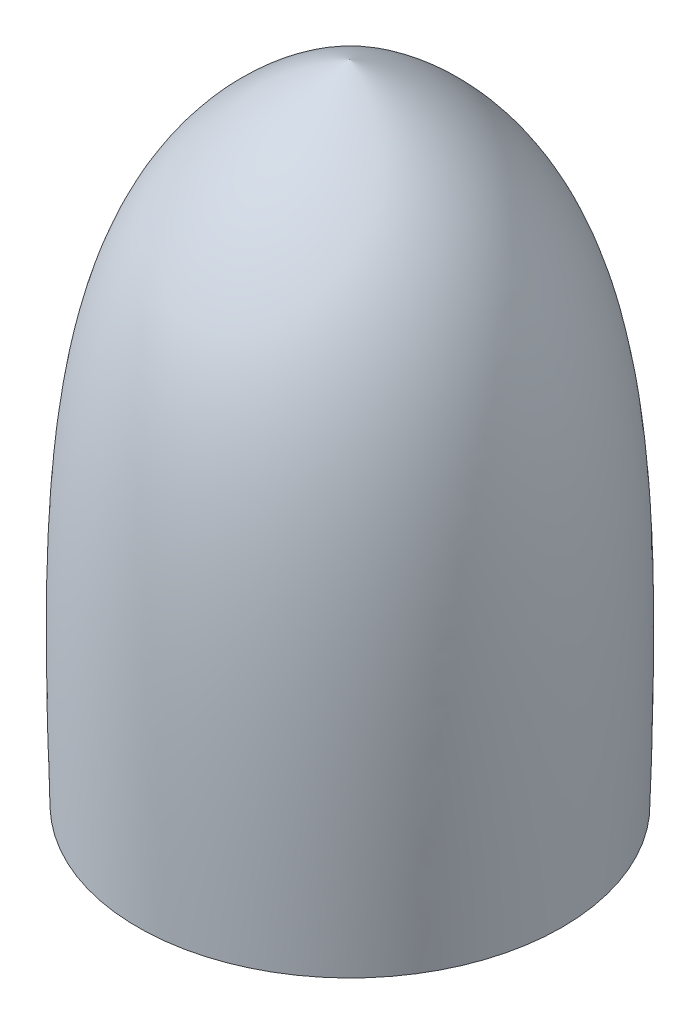
ISO-10303-21;
HEADER;
FILE_DESCRIPTION(('STEP AP214'),'2;1');
FILE_NAME('part.step','',(''),(''),'','','');
FILE_SCHEMA(('AUTOMOTIVE_DESIGN { 1 0 10303 214 1 1 1 1 }'));
ENDSEC;
DATA;
#1=APPLICATION_CONTEXT('core data for automotive mechanical design processes');
#2=APPLICATION_PROTOCOL_DEFINITION('international standard','automotive_design',2000,#1);
#3=PRODUCT_CONTEXT('',#1,'mechanical');
#4=PRODUCT('Part','Part','',(#3));
#5=PRODUCT_RELATED_PRODUCT_CATEGORY('part','',(#4));
#6=PRODUCT_DEFINITION_FORMATION('','',#4);
#7=PRODUCT_DEFINITION_CONTEXT('part definition',#1,'design');
#8=PRODUCT_DEFINITION('design','',#6,#7);
#9=PRODUCT_DEFINITION_SHAPE('','',#8);
#10=(LENGTH_UNIT() NAMED_UNIT(*) SI_UNIT(.MILLI.,.METRE.));
#11=(NAMED_UNIT(*) PLANE_ANGLE_UNIT() SI_UNIT($,.RADIAN.));
#12=(NAMED_UNIT(*) SI_UNIT($,.STERADIAN.) SOLID_ANGLE_UNIT());
#13=UNCERTAINTY_MEASURE_WITH_UNIT(LENGTH_MEASURE(1.E-05),#10,'distance_accuracy_value','');
#14=(GEOMETRIC_REPRESENTATION_CONTEXT(3) GLOBAL_UNCERTAINTY_ASSIGNED_CONTEXT((#13)) GLOBAL_UNIT_ASSIGNED_CONTEXT((#10,
#11,#12)) REPRESENTATION_CONTEXT('',''));
#15=CARTESIAN_POINT('',(0.,0.,0.));
#16=DIRECTION('',(0.,0.,1.));
#17=DIRECTION('',(1.,0.,0.));
#18=AXIS2_PLACEMENT_3D('',#15,#16,#17);
#19=CARTESIAN_POINT('',(-2.30129840200414,-3.30400876547769,0.));
#20=CARTESIAN_POINT('',(-2.41046027144387,0.516656664912789,0.));
#21=CARTESIAN_POINT('',(-2.31841510847184,2.75823016193829,0.));
#22=CARTESIAN_POINT('',(0.,3.69599123452232,0.));
#23=B_SPLINE_CURVE_WITH_KNOTS('',3,(#19,#20,#21,#22),.UNSPECIFIED.,.F.,.F.,(4,4),(0.,1.),.UNSPECIFIED.);
#24=CARTESIAN_POINT('',(0.,3.69599123452232,0.));
#25=DIRECTION('',(0.,1.,0.));
#26=AXIS1_PLACEMENT('',#24,#25);
#27=SURFACE_OF_REVOLUTION('',#23,#26);
#28=CARTESIAN_POINT('',(0.,3.69599123452232,0.));
#29=VERTEX_POINT('',#28);
#30=VERTEX_LOOP('',#29);
#31=FACE_BOUND('',#30,.T.);
#32=CARTESIAN_POINT('',(0.,-3.30400876547768,0.));
#33=DIRECTION('',(0.,-1.,0.));
#34=DIRECTION('',(1.,0.,0.));
#35=AXIS2_PLACEMENT_3D('',#32,#33,#34);
#36=CIRCLE('',#35,2.30129840200414);
#37=CARTESIAN_POINT('',(2.30129840200414,-3.30400876547768,0.));
#38=VERTEX_POINT('',#37);
#39=EDGE_CURVE('E54',#38,#38,#36,.T.);
#40=ORIENTED_EDGE('',*,*,#39,.F.);
#41=EDGE_LOOP('',(#40));
#42=FACE_BOUND('',#41,.T.);
#43=ADVANCED_FACE('F39',(#31,#42),#27,.T.);
#44=CARTESIAN_POINT('',(-1.2,2.69599123452232,0.));
#45=DIRECTION('',(0.,1.,0.));
#46=DIRECTION('',(1.,0.,0.));
#47=AXIS2_PLACEMENT_3D('',#44,#45,#46);
#48=PLANE('',#47);
#49=CARTESIAN_POINT('',(0.,2.69599123452232,0.));
#50=DIRECTION('',(0.,-1.,0.));
#51=DIRECTION('',(1.,0.,0.));
#52=AXIS2_PLACEMENT_3D('',#49,#50,#51);
#53=CIRCLE('',#52,1.2);
#54=CARTESIAN_POINT('',(1.2,2.69599123452232,0.));
#55=VERTEX_POINT('',#54);
#56=EDGE_CURVE('E11',#55,#55,#53,.T.);
#57=ORIENTED_EDGE('',*,*,#56,.T.);
#58=EDGE_LOOP('',(#57));
#59=FACE_BOUND('',#58,.T.);
#60=ADVANCED_FACE('F51',(#59),#48,.F.);
#61=CARTESIAN_POINT('',(0.,3.69599123452232,0.));
#62=DIRECTION('',(0.,1.,0.));
#63=DIRECTION('',(1.,0.,0.));
#64=AXIS2_PLACEMENT_3D('',#61,#62,#63);
#65=CYLINDRICAL_SURFACE('',#64,1.2);
#66=CARTESIAN_POINT('',(0.,-3.30400876547768,0.));
#67=DIRECTION('',(0.,-1.,0.));
#68=DIRECTION('',(1.,0.,0.));
#69=AXIS2_PLACEMENT_3D('',#66,#67,#68);
#70=CIRCLE('',#69,1.2);
#71=CARTESIAN_POINT('',(1.2,-3.30400876547768,0.));
#72=VERTEX_POINT('',#71);
#73=EDGE_CURVE('E46',#72,#72,#70,.T.);
#74=ORIENTED_EDGE('',*,*,#73,.T.);
#75=EDGE_LOOP('',(#74));
#76=FACE_BOUND('',#75,.T.);
#77=ORIENTED_EDGE('',*,*,#56,.F.);
#78=EDGE_LOOP('',(#77));
#79=FACE_BOUND('',#78,.T.);
#80=ADVANCED_FACE('F66',(#76,#79),#65,.F.);
#81=CARTESIAN_POINT('',(-1.2,-3.30400876547768,0.));
#82=DIRECTION('',(0.,1.,0.));
#83=DIRECTION('',(1.,0.,0.));
#84=AXIS2_PLACEMENT_3D('',#81,#82,#83);
#85=PLANE('',#84);
#86=ORIENTED_EDGE('',*,*,#39,.T.);
#87=EDGE_LOOP('',(#86));
#88=FACE_BOUND('',#87,.T.);
#89=ORIENTED_EDGE('',*,*,#73,.F.);
#90=EDGE_LOOP('',(#89));
#91=FACE_BOUND('',#90,.T.);
#92=ADVANCED_FACE('F69',(#88,#91),#85,.F.);
#93=CLOSED_SHELL('',(#43,#60,#80,#92));
#94=MANIFOLD_SOLID_BREP('B2',#93);
#95=ADVANCED_BREP_SHAPE_REPRESENTATION('',(#18,#94),#14);
#96=SHAPE_DEFINITION_REPRESENTATION(#9,#95);
ENDSEC;
END-ISO-10303-21;
